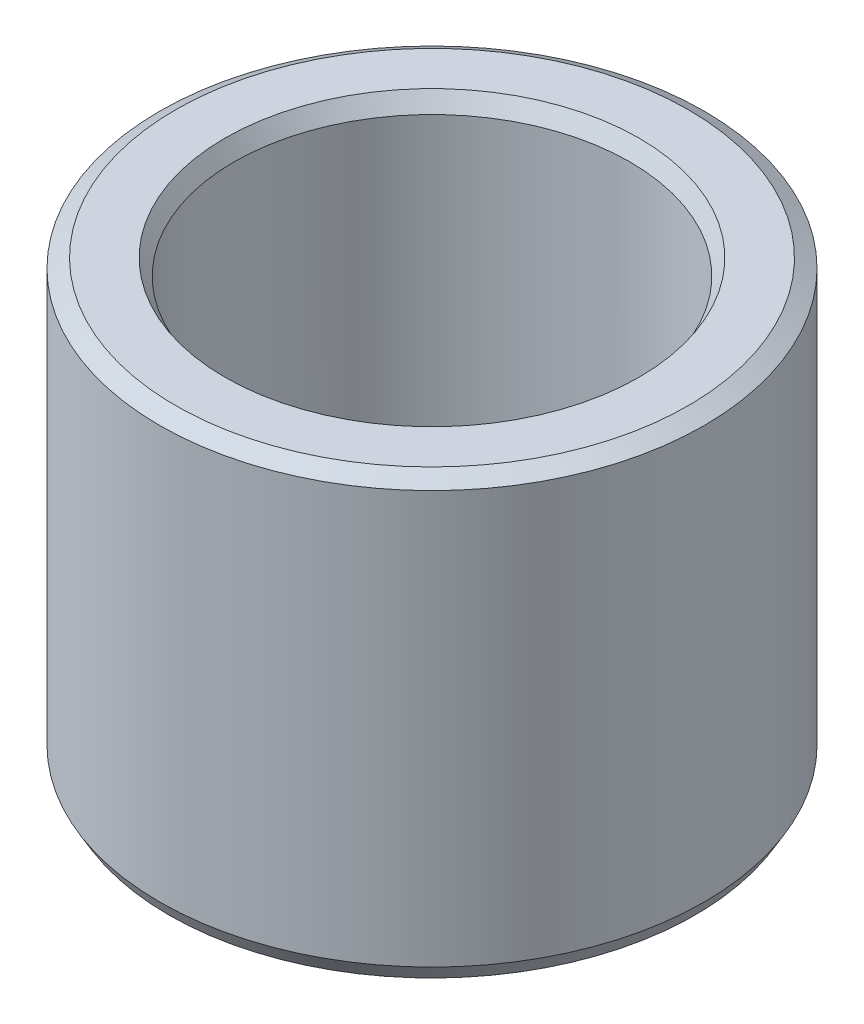
ISO-10303-21;
HEADER;
FILE_DESCRIPTION(('STEP AP214'),'2;1');
FILE_NAME('part.step','',(''),(''),'','','');
FILE_SCHEMA(('AUTOMOTIVE_DESIGN { 1 0 10303 214 1 1 1 1 }'));
ENDSEC;
DATA;
#1=APPLICATION_CONTEXT('core data for automotive mechanical design processes');
#2=APPLICATION_PROTOCOL_DEFINITION('international standard','automotive_design',2000,#1);
#3=PRODUCT_CONTEXT('',#1,'mechanical');
#4=PRODUCT('Part','Part','',(#3));
#5=PRODUCT_RELATED_PRODUCT_CATEGORY('part','',(#4));
#6=PRODUCT_DEFINITION_FORMATION('','',#4);
#7=PRODUCT_DEFINITION_CONTEXT('part definition',#1,'design');
#8=PRODUCT_DEFINITION('design','',#6,#7);
#9=PRODUCT_DEFINITION_SHAPE('','',#8);
#10=(LENGTH_UNIT() NAMED_UNIT(*) SI_UNIT(.MILLI.,.METRE.));
#11=(NAMED_UNIT(*) PLANE_ANGLE_UNIT() SI_UNIT($,.RADIAN.));
#12=(NAMED_UNIT(*) SI_UNIT($,.STERADIAN.) SOLID_ANGLE_UNIT());
#13=UNCERTAINTY_MEASURE_WITH_UNIT(LENGTH_MEASURE(1.E-05),#10,'distance_accuracy_value','');
#14=(GEOMETRIC_REPRESENTATION_CONTEXT(3) GLOBAL_UNCERTAINTY_ASSIGNED_CONTEXT((#13)) GLOBAL_UNIT_ASSIGNED_CONTEXT((#10,
#11,#12)) REPRESENTATION_CONTEXT('',''));
#15=CARTESIAN_POINT('',(0.,0.,0.));
#16=DIRECTION('',(0.,0.,1.));
#17=DIRECTION('',(1.,0.,0.));
#18=AXIS2_PLACEMENT_3D('',#15,#16,#17);
#19=CARTESIAN_POINT('',(0.,80.4016919559052,0.));
#20=DIRECTION('',(0.,-1.,0.));
#21=DIRECTION('',(0.,0.,-1.));
#22=AXIS2_PLACEMENT_3D('',#19,#20,#21);
#23=CYLINDRICAL_SURFACE('',#22,50.);
#24=CARTESIAN_POINT('',(0.,2.92925815149078,0.));
#25=DIRECTION('',(0.,1.,0.));
#26=DIRECTION('',(0.,0.,1.));
#27=AXIS2_PLACEMENT_3D('',#24,#25,#26);
#28=CIRCLE('',#27,50.);
#29=CARTESIAN_POINT('',(0.,2.92925815149078,50.));
#30=VERTEX_POINT('',#29);
#31=EDGE_CURVE('E10',#30,#30,#28,.T.);
#32=ORIENTED_EDGE('',*,*,#31,.T.);
#33=EDGE_LOOP('',(#32));
#34=FACE_BOUND('',#33,.T.);
#35=CARTESIAN_POINT('',(0.,78.710483973616,0.));
#36=DIRECTION('',(0.,1.,0.));
#37=DIRECTION('',(0.,0.,1.));
#38=AXIS2_PLACEMENT_3D('',#35,#36,#37);
#39=CIRCLE('',#38,50.);
#40=CARTESIAN_POINT('',(0.,78.710483973616,-50.));
#41=VERTEX_POINT('',#40);
#42=EDGE_CURVE('E50',#41,#41,#39,.F.);
#43=ORIENTED_EDGE('',*,*,#42,.T.);
#44=EDGE_LOOP('',(#43));
#45=FACE_BOUND('',#44,.T.);
#46=ADVANCED_FACE('F39',(#34,#45),#23,.T.);
#47=CARTESIAN_POINT('',(0.,80.4016919559052,0.));
#48=DIRECTION('',(0.,1.,0.));
#49=DIRECTION('',(0.,0.,1.));
#50=AXIS2_PLACEMENT_3D('',#47,#48,#49);
#51=PLANE('',#50);
#52=CARTESIAN_POINT('',(0.,80.4016919559052,0.));
#53=DIRECTION('',(0.,1.,0.));
#54=DIRECTION('',(0.,0.,1.));
#55=AXIS2_PLACEMENT_3D('',#52,#53,#54);
#56=CIRCLE('',#55,38.0318637097026);
#57=CARTESIAN_POINT('',(0.,80.4016919559052,38.0318637097026));
#58=VERTEX_POINT('',#57);
#59=EDGE_CURVE('E58',#58,#58,#56,.F.);
#60=ORIENTED_EDGE('',*,*,#59,.T.);
#61=EDGE_LOOP('',(#60));
#62=FACE_BOUND('',#61,.T.);
#63=CARTESIAN_POINT('',(0.,80.4016919559052,0.));
#64=DIRECTION('',(0.,1.,0.));
#65=DIRECTION('',(0.,0.,1.));
#66=AXIS2_PLACEMENT_3D('',#63,#64,#65);
#67=CIRCLE('',#66,47.0707418485092);
#68=CARTESIAN_POINT('',(0.,80.4016919559052,-47.0707418485093));
#69=VERTEX_POINT('',#68);
#70=EDGE_CURVE('E61',#69,#69,#67,.T.);
#71=ORIENTED_EDGE('',*,*,#70,.T.);
#72=EDGE_LOOP('',(#71));
#73=FACE_BOUND('',#72,.T.);
#74=ADVANCED_FACE('F88',(#62,#73),#51,.T.);
#75=CARTESIAN_POINT('',(0.,0.,0.));
#76=DIRECTION('',(0.,1.,0.));
#77=DIRECTION('',(0.,0.,1.));
#78=AXIS2_PLACEMENT_3D('',#75,#76,#77);
#79=PLANE('',#78);
#80=CARTESIAN_POINT('',(0.,0.,0.));
#81=DIRECTION('',(0.,1.,0.));
#82=DIRECTION('',(0.,0.,1.));
#83=AXIS2_PLACEMENT_3D('',#80,#81,#82);
#84=CIRCLE('',#83,39.2699138789042);
#85=CARTESIAN_POINT('',(0.,0.,-39.2699138789042));
#86=VERTEX_POINT('',#85);
#87=EDGE_CURVE('E51',#86,#86,#84,.T.);
#88=ORIENTED_EDGE('',*,*,#87,.T.);
#89=EDGE_LOOP('',(#88));
#90=FACE_BOUND('',#89,.T.);
#91=CARTESIAN_POINT('',(0.,0.,0.));
#92=DIRECTION('',(0.,1.,0.));
#93=DIRECTION('',(0.,0.,1.));
#94=AXIS2_PLACEMENT_3D('',#91,#92,#93);
#95=CIRCLE('',#94,48.3087920177109);
#96=CARTESIAN_POINT('',(0.,0.,48.3087920177109));
#97=VERTEX_POINT('',#96);
#98=EDGE_CURVE('E54',#97,#97,#95,.F.);
#99=ORIENTED_EDGE('',*,*,#98,.T.);
#100=EDGE_LOOP('',(#99));
#101=FACE_BOUND('',#100,.T.);
#102=ADVANCED_FACE('F83',(#90,#101),#79,.F.);
#103=CARTESIAN_POINT('',(0.,80.4016919559052,0.));
#104=DIRECTION('',(0.,-1.,0.));
#105=DIRECTION('',(0.,0.,-1.));
#106=AXIS2_PLACEMENT_3D('',#103,#104,#105);
#107=CYLINDRICAL_SURFACE('',#106,36.3406557274135);
#108=CARTESIAN_POINT('',(0.,77.4724338044144,0.));
#109=DIRECTION('',(0.,1.,0.));
#110=DIRECTION('',(0.,0.,1.));
#111=AXIS2_PLACEMENT_3D('',#108,#109,#110);
#112=CIRCLE('',#111,36.3406557274135);
#113=CARTESIAN_POINT('',(0.,77.4724338044144,36.3406557274135));
#114=VERTEX_POINT('',#113);
#115=EDGE_CURVE('E67',#114,#114,#112,.T.);
#116=ORIENTED_EDGE('',*,*,#115,.T.);
#117=EDGE_LOOP('',(#116));
#118=FACE_BOUND('',#117,.T.);
#119=CARTESIAN_POINT('',(0.,1.69120798228911,0.));
#120=DIRECTION('',(0.,1.,0.));
#121=DIRECTION('',(0.,0.,1.));
#122=AXIS2_PLACEMENT_3D('',#119,#120,#121);
#123=CIRCLE('',#122,36.3406557274135);
#124=CARTESIAN_POINT('',(0.,1.69120798228911,-36.3406557274135));
#125=VERTEX_POINT('',#124);
#126=EDGE_CURVE('E69',#125,#125,#123,.F.);
#127=ORIENTED_EDGE('',*,*,#126,.T.);
#128=EDGE_LOOP('',(#127));
#129=FACE_BOUND('',#128,.T.);
#130=ADVANCED_FACE('F71',(#118,#129),#107,.F.);
#131=CARTESIAN_POINT('',(0.,77.4724338044144,0.));
#132=DIRECTION('',(0.,1.,0.));
#133=DIRECTION('',(0.,0.,1.));
#134=AXIS2_PLACEMENT_3D('',#131,#132,#133);
#135=CONICAL_SURFACE('',#134,36.3406557274135,0.523598775598302);
#136=ORIENTED_EDGE('',*,*,#59,.F.);
#137=EDGE_LOOP('',(#136));
#138=FACE_BOUND('',#137,.T.);
#139=ORIENTED_EDGE('',*,*,#115,.F.);
#140=EDGE_LOOP('',(#139));
#141=FACE_BOUND('',#140,.T.);
#142=ADVANCED_FACE('F77',(#138,#141),#135,.F.);
#143=CARTESIAN_POINT('',(0.,0.,0.));
#144=DIRECTION('',(0.,-1.,0.));
#145=DIRECTION('',(0.,0.,-1.));
#146=AXIS2_PLACEMENT_3D('',#143,#144,#145);
#147=CONICAL_SURFACE('',#146,39.2699138789042,1.04719755119659);
#148=CARTESIAN_POINT('',(0.,1.69120798228911,-36.3406557274135));
#149=CARTESIAN_POINT('',(0.,1.6735912324736,-36.3711688331582));
#150=CARTESIAN_POINT('',(0.,1.65597448265809,-36.4016819389029));
#151=CARTESIAN_POINT('',(0.,1.62074098302707,-36.4627081503923));
#152=CARTESIAN_POINT('',(0.,1.60312423321155,-36.493221256137));
#153=CARTESIAN_POINT('',(0.,1.56789073358053,-36.5542474676264));
#154=CARTESIAN_POINT('',(0.,1.55027398376502,-36.584760573371));
#155=CARTESIAN_POINT('',(0.,1.51504048413399,-36.6457867848604));
#156=CARTESIAN_POINT('',(0.,1.49742373431848,-36.6762998906051));
#157=CARTESIAN_POINT('',(0.,1.46219023468746,-36.7373261020945));
#158=CARTESIAN_POINT('',(0.,1.44457348487195,-36.7678392078392));
#159=CARTESIAN_POINT('',(0.,1.40933998524093,-36.8288654193286));
#160=CARTESIAN_POINT('',(0.,1.39172323542541,-36.8593785250733));
#161=CARTESIAN_POINT('',(0.,1.35648973579439,-36.9204047365627));
#162=CARTESIAN_POINT('',(0.,1.33887298597888,-36.9509178423074));
#163=CARTESIAN_POINT('',(0.,1.30363948634786,-37.0119440537968));
#164=CARTESIAN_POINT('',(0.,1.28602273653234,-37.0424571595415));
#165=CARTESIAN_POINT('',(0.,1.25078923690132,-37.1034833710309));
#166=CARTESIAN_POINT('',(0.,1.23317248708581,-37.1339964767756));
#167=CARTESIAN_POINT('',(0.,1.19793898745479,-37.195022688265));
#168=CARTESIAN_POINT('',(0.,1.18032223763928,-37.2255357940097));
#169=CARTESIAN_POINT('',(0.,1.14508873800825,-37.2865620054991));
#170=CARTESIAN_POINT('',(0.,1.12747198819274,-37.3170751112437));
#171=CARTESIAN_POINT('',(0.,1.09223848856172,-37.3781013227331));
#172=CARTESIAN_POINT('',(0.,1.07462173874621,-37.4086144284778));
#173=CARTESIAN_POINT('',(0.,1.03938823911518,-37.4696406399672));
#174=CARTESIAN_POINT('',(0.,1.02177148929967,-37.5001537457119));
#175=CARTESIAN_POINT('',(0.,0.986537989668648,-37.5611799572013));
#176=CARTESIAN_POINT('',(0.,0.968921239853136,-37.591693062946));
#177=CARTESIAN_POINT('',(0.,0.933687740222113,-37.6527192744354));
#178=CARTESIAN_POINT('',(0.,0.916070990406602,-37.6832323801801));
#179=CARTESIAN_POINT('',(0.,0.880837490775579,-37.7442585916695));
#180=CARTESIAN_POINT('',(0.,0.863220740960067,-37.7747716974142));
#181=CARTESIAN_POINT('',(0.,0.827987241329044,-37.8357979089036));
#182=CARTESIAN_POINT('',(0.,0.810370491513532,-37.8663110146483));
#183=CARTESIAN_POINT('',(0.,0.775136991882509,-37.9273372261377));
#184=CARTESIAN_POINT('',(0.,0.757520242066998,-37.9578503318823));
#185=CARTESIAN_POINT('',(0.,0.722286742435975,-38.0188765433717));
#186=CARTESIAN_POINT('',(0.,0.704669992620463,-38.0493896491164));
#187=CARTESIAN_POINT('',(0.,0.669436492989439,-38.1104158606058));
#188=CARTESIAN_POINT('',(0.,0.651819743173928,-38.1409289663505));
#189=CARTESIAN_POINT('',(0.,0.616586243542905,-38.2019551778399));
#190=CARTESIAN_POINT('',(0.,0.598969493727394,-38.2324682835846));
#191=CARTESIAN_POINT('',(0.,0.563735994096371,-38.293494495074));
#192=CARTESIAN_POINT('',(0.,0.546119244280858,-38.3240076008187));
#193=CARTESIAN_POINT('',(0.,0.510885744649835,-38.3850338123081));
#194=CARTESIAN_POINT('',(0.,0.493268994834324,-38.4155469180528));
#195=CARTESIAN_POINT('',(0.,0.458035495203301,-38.4765731295422));
#196=CARTESIAN_POINT('',(0.,0.440418745387789,-38.5070862352869));
#197=CARTESIAN_POINT('',(0.,0.405185245756766,-38.5681124467762));
#198=CARTESIAN_POINT('',(0.,0.387568495941254,-38.598625552521));
#199=CARTESIAN_POINT('',(0.,0.352334996310232,-38.6596517640103));
#200=CARTESIAN_POINT('',(0.,0.334718246494721,-38.690164869755));
#201=CARTESIAN_POINT('',(0.,0.299484746863697,-38.7511910812444));
#202=CARTESIAN_POINT('',(0.,0.281867997048185,-38.7817041869891));
#203=CARTESIAN_POINT('',(0.,0.246634497417161,-38.8427303984785));
#204=CARTESIAN_POINT('',(0.,0.22901774760165,-38.8732435042232));
#205=CARTESIAN_POINT('',(0.,0.193784247970628,-38.9342697157126));
#206=CARTESIAN_POINT('',(0.,0.176167498155116,-38.9647828214573));
#207=CARTESIAN_POINT('',(0.,0.140933998524093,-39.0258090329467));
#208=CARTESIAN_POINT('',(0.,0.123317248708581,-39.0563221386914));
#209=CARTESIAN_POINT('',(0.,0.0880837490775572,-39.1173483501808));
#210=CARTESIAN_POINT('',(0.,0.070466999262046,-39.1478614559255));
#211=CARTESIAN_POINT('',(0.,0.0352334996310235,-39.2088876674148));
#212=CARTESIAN_POINT('',(0.,0.0176167498155122,-39.2394007731596));
#213=CARTESIAN_POINT('',(0.,0.,-39.2699138789042));
#214=B_SPLINE_CURVE_WITH_KNOTS('',3,(#148,#149,#150,#151,#152,#153,#154,#155,#156,#157,#158,
#159,#160,#161,#162,#163,#164,#165,#166,#167,#168,#169,#170,#171,#172,#173,#174,#175,#176,#177,
#178,#179,#180,#181,#182,#183,#184,#185,#186,#187,#188,#189,#190,#191,#192,#193,#194,#195,#196,
#197,#198,#199,#200,#201,#202,#203,#204,#205,#206,#207,#208,#209,#210,#211,#212,#213),
.UNSPECIFIED.,.F.,.F.,(4,2,2,2,2,2,2,2,2,2,2,2,2,2,2,2,2,2,2,2,2,2,2,2,2,2,2,2,2,2,2,2,4),(0.,
0.10570049889307,0.21140099778614,0.317101496679204,0.422801995572274,0.528502494465344,
0.634202993358408,0.739903492251479,0.845603991144549,0.951304490037619,1.05700498893069,
1.16270548782375,1.26840598671682,1.37410648560989,1.47980698450296,1.58550748339603,
1.6912079822891,1.79690848118217,1.90260898007524,2.0083094789683,2.11400997786137,
2.21971047675444,2.32541097564751,2.43111147454058,2.53681197343365,2.64251247232672,
2.74821297121979,2.85391347011285,2.95961396900592,3.06531446789899,3.17101496679205,
3.27671546568512,3.38241596457819),.UNSPECIFIED.);
#215=EDGE_CURVE('BSEAM73',#125,#86,#214,.T.);
#216=ORIENTED_EDGE('',*,*,#126,.F.);
#217=ORIENTED_EDGE('',*,*,#87,.F.);
#218=ORIENTED_EDGE('',*,*,#215,.T.);
#219=ORIENTED_EDGE('',*,*,#215,.F.);
#220=EDGE_LOOP('',(#216,#218,#217,#219));
#221=FACE_BOUND('',#220,.T.);
#222=ADVANCED_FACE('F73',(#221),#147,.F.);
#223=CARTESIAN_POINT('',(0.,2.92925815149078,0.));
#224=DIRECTION('',(0.,1.,0.));
#225=DIRECTION('',(0.,0.,1.));
#226=AXIS2_PLACEMENT_3D('',#223,#224,#225);
#227=CONICAL_SURFACE('',#226,50.,0.523598775598305);
#228=ORIENTED_EDGE('',*,*,#98,.F.);
#229=EDGE_LOOP('',(#228));
#230=FACE_BOUND('',#229,.T.);
#231=ORIENTED_EDGE('',*,*,#31,.F.);
#232=EDGE_LOOP('',(#231));
#233=FACE_BOUND('',#232,.T.);
#234=ADVANCED_FACE('F76',(#230,#233),#227,.T.);
#235=CARTESIAN_POINT('',(0.,80.4016919559052,0.));
#236=DIRECTION('',(0.,-1.,0.));
#237=DIRECTION('',(0.,0.,-1.));
#238=AXIS2_PLACEMENT_3D('',#235,#236,#237);
#239=CONICAL_SURFACE('',#238,47.0707418485092,1.04719755119659);
#240=CARTESIAN_POINT('',(0.,78.710483973616,-50.));
#241=CARTESIAN_POINT('',(0.,78.7281007234316,-49.9694868942553));
#242=CARTESIAN_POINT('',(0.,78.7457174732471,-49.9389737885106));
#243=CARTESIAN_POINT('',(0.,78.7809509728781,-49.8779475770212));
#244=CARTESIAN_POINT('',(0.,78.7985677226936,-49.8474344712765));
#245=CARTESIAN_POINT('',(0.,78.8338012223246,-49.7864082597871));
#246=CARTESIAN_POINT('',(0.,78.8514179721401,-49.7558951540424));
#247=CARTESIAN_POINT('',(0.,78.8866514717711,-49.6948689425531));
#248=CARTESIAN_POINT('',(0.,78.9042682215867,-49.6643558368084));
#249=CARTESIAN_POINT('',(0.,78.9395017212177,-49.603329625319));
#250=CARTESIAN_POINT('',(0.,78.9571184710332,-49.5728165195743));
#251=CARTESIAN_POINT('',(0.,78.9923519706642,-49.5117903080849));
#252=CARTESIAN_POINT('',(0.,79.0099687204797,-49.4812772023402));
#253=CARTESIAN_POINT('',(0.,79.0452022201108,-49.4202509908508));
#254=CARTESIAN_POINT('',(0.,79.0628189699263,-49.3897378851061));
#255=CARTESIAN_POINT('',(0.,79.0980524695573,-49.3287116736167));
#256=CARTESIAN_POINT('',(0.,79.1156692193728,-49.298198567872));
#257=CARTESIAN_POINT('',(0.,79.1509027190038,-49.2371723563826));
#258=CARTESIAN_POINT('',(0.,79.1685194688193,-49.2066592506379));
#259=CARTESIAN_POINT('',(0.,79.2037529684504,-49.1456330391485));
#260=CARTESIAN_POINT('',(0.,79.2213697182659,-49.1151199334039));
#261=CARTESIAN_POINT('',(0.,79.2566032178969,-49.0540937219145));
#262=CARTESIAN_POINT('',(0.,79.2742199677124,-49.0235806161698));
#263=CARTESIAN_POINT('',(0.,79.3094534673434,-48.9625544046804));
#264=CARTESIAN_POINT('',(0.,79.3270702171589,-48.9320412989357));
#265=CARTESIAN_POINT('',(0.,79.36230371679,-48.8710150874463));
#266=CARTESIAN_POINT('',(0.,79.3799204666055,-48.8405019817016));
#267=CARTESIAN_POINT('',(0.,79.4151539662365,-48.7794757702122));
#268=CARTESIAN_POINT('',(0.,79.432770716052,-48.7489626644675));
#269=CARTESIAN_POINT('',(0.,79.468004215683,-48.6879364529781));
#270=CARTESIAN_POINT('',(0.,79.4856209654986,-48.6574233472334));
#271=CARTESIAN_POINT('',(0.,79.5208544651296,-48.596397135744));
#272=CARTESIAN_POINT('',(0.,79.5384712149451,-48.5658840299993));
#273=CARTESIAN_POINT('',(0.,79.5737047145761,-48.5048578185099));
#274=CARTESIAN_POINT('',(0.,79.5913214643916,-48.4743447127652));
#275=CARTESIAN_POINT('',(0.,79.6265549640226,-48.4133185012759));
#276=CARTESIAN_POINT('',(0.,79.6441717138382,-48.3828053955312));
#277=CARTESIAN_POINT('',(0.,79.6794052134692,-48.3217791840418));
#278=CARTESIAN_POINT('',(0.,79.6970219632847,-48.2912660782971));
#279=CARTESIAN_POINT('',(0.,79.7322554629157,-48.2302398668077));
#280=CARTESIAN_POINT('',(0.,79.7498722127312,-48.199726761063));
#281=CARTESIAN_POINT('',(0.,79.7851057123623,-48.1387005495736));
#282=CARTESIAN_POINT('',(0.,79.8027224621778,-48.1081874438289));
#283=CARTESIAN_POINT('',(0.,79.8379559618088,-48.0471612323395));
#284=CARTESIAN_POINT('',(0.,79.8555727116243,-48.0166481265948));
#285=CARTESIAN_POINT('',(0.,79.8908062112553,-47.9556219151054));
#286=CARTESIAN_POINT('',(0.,79.9084229610708,-47.9251088093607));
#287=CARTESIAN_POINT('',(0.,79.9436564607019,-47.8640825978713));
#288=CARTESIAN_POINT('',(0.,79.9612732105174,-47.8335694921266));
#289=CARTESIAN_POINT('',(0.,79.9965067101484,-47.7725432806372));
#290=CARTESIAN_POINT('',(0.,80.0141234599639,-47.7420301748925));
#291=CARTESIAN_POINT('',(0.,80.0493569595949,-47.6810039634032));
#292=CARTESIAN_POINT('',(0.,80.0669737094104,-47.6504908576585));
#293=CARTESIAN_POINT('',(0.,80.1022072090415,-47.5894646461691));
#294=CARTESIAN_POINT('',(0.,80.119823958857,-47.5589515404244));
#295=CARTESIAN_POINT('',(0.,80.155057458488,-47.497925328935));
#296=CARTESIAN_POINT('',(0.,80.1726742083035,-47.4674122231903));
#297=CARTESIAN_POINT('',(0.,80.2079077079345,-47.4063860117009));
#298=CARTESIAN_POINT('',(0.,80.22552445775,-47.3758729059562));
#299=CARTESIAN_POINT('',(0.,80.2607579573811,-47.3148466944668));
#300=CARTESIAN_POINT('',(0.,80.2783747071966,-47.2843335887221));
#301=CARTESIAN_POINT('',(0.,80.3136082068276,-47.2233073772327));
#302=CARTESIAN_POINT('',(0.,80.3312249566431,-47.192794271488));
#303=CARTESIAN_POINT('',(0.,80.3664584562741,-47.1317680599986));
#304=CARTESIAN_POINT('',(0.,80.3840752060896,-47.1012549542539));
#305=CARTESIAN_POINT('',(0.,80.4016919559052,-47.0707418485093));
#306=B_SPLINE_CURVE_WITH_KNOTS('',3,(#240,#241,#242,#243,#244,#245,#246,#247,#248,#249,#250,
#251,#252,#253,#254,#255,#256,#257,#258,#259,#260,#261,#262,#263,#264,#265,#266,#267,#268,#269,
#270,#271,#272,#273,#274,#275,#276,#277,#278,#279,#280,#281,#282,#283,#284,#285,#286,#287,#288,
#289,#290,#291,#292,#293,#294,#295,#296,#297,#298,#299,#300,#301,#302,#303,#304,#305),
.UNSPECIFIED.,.F.,.F.,(4,2,2,2,2,2,2,2,2,2,2,2,2,2,2,2,2,2,2,2,2,2,2,2,2,2,2,2,2,2,2,2,4),(0.,
0.105700498893073,0.211400997786145,0.317101496679211,0.422801995572278,0.528502494465351,
0.634202993358416,0.739903492251489,0.845603991144555,0.951304490037621,1.05700498893069,
1.16270548782376,1.26840598671683,1.37410648560991,1.47980698450297,1.58550748339604,
1.6912079822891,1.79690848118218,1.90260898007525,2.00830947896831,2.11400997786138,
2.21971047675445,2.32541097564752,2.43111147454059,2.53681197343366,2.64251247232673,
2.7482129712198,2.85391347011286,2.95961396900593,3.06531446789901,3.17101496679207,
3.27671546568514,3.38241596457821),.UNSPECIFIED.);
#307=EDGE_CURVE('BSEAM45',#41,#69,#306,.T.);
#308=ORIENTED_EDGE('',*,*,#42,.F.);
#309=ORIENTED_EDGE('',*,*,#70,.F.);
#310=ORIENTED_EDGE('',*,*,#307,.T.);
#311=ORIENTED_EDGE('',*,*,#307,.F.);
#312=EDGE_LOOP('',(#308,#310,#309,#311));
#313=FACE_BOUND('',#312,.T.);
#314=ADVANCED_FACE('F45',(#313),#239,.T.);
#315=CLOSED_SHELL('',(#46,#74,#102,#130,#142,#222,#234,#314));
#316=MANIFOLD_SOLID_BREP('B2',#315);
#317=ADVANCED_BREP_SHAPE_REPRESENTATION('',(#18,#316),#14);
#318=SHAPE_DEFINITION_REPRESENTATION(#9,#317);
ENDSEC;
END-ISO-10303-21;
